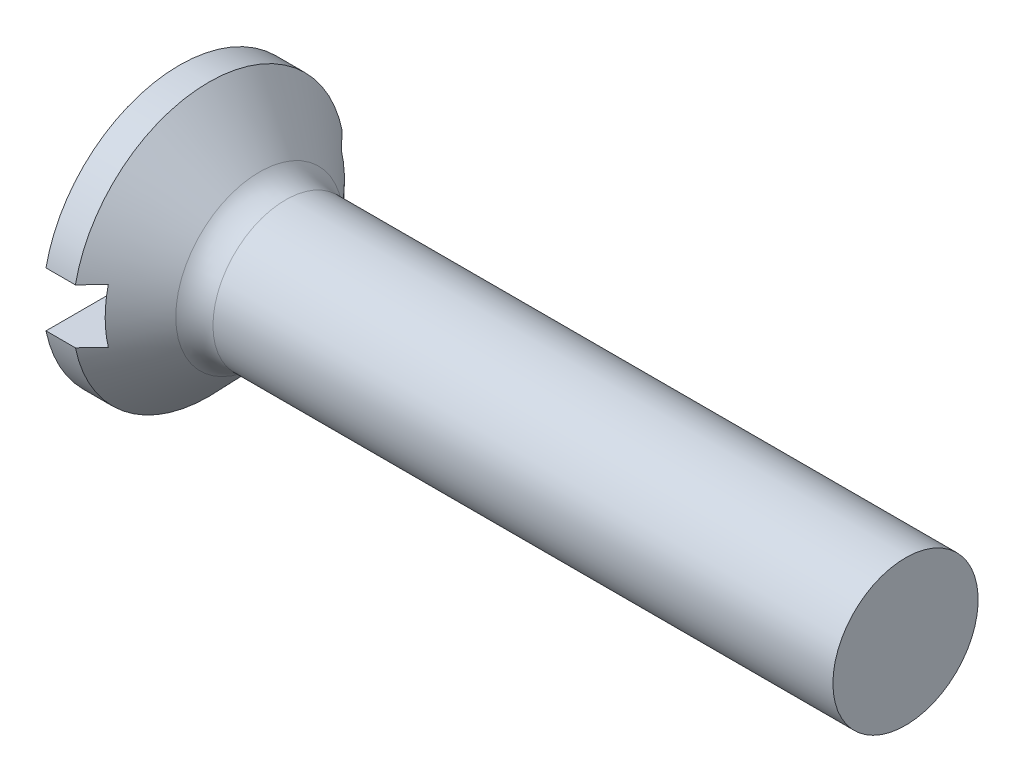
ISO-10303-21;
HEADER;
FILE_DESCRIPTION(('STEP AP214'),'2;1');
FILE_NAME('part.step','',(''),(''),'','','');
FILE_SCHEMA(('AUTOMOTIVE_DESIGN { 1 0 10303 214 1 1 1 1 }'));
ENDSEC;
DATA;
#1=APPLICATION_CONTEXT('core data for automotive mechanical design processes');
#2=APPLICATION_PROTOCOL_DEFINITION('international standard','automotive_design',2000,#1);
#3=PRODUCT_CONTEXT('',#1,'mechanical');
#4=PRODUCT('Part','Part','',(#3));
#5=PRODUCT_RELATED_PRODUCT_CATEGORY('part','',(#4));
#6=PRODUCT_DEFINITION_FORMATION('','',#4);
#7=PRODUCT_DEFINITION_CONTEXT('part definition',#1,'design');
#8=PRODUCT_DEFINITION('design','',#6,#7);
#9=PRODUCT_DEFINITION_SHAPE('','',#8);
#10=(LENGTH_UNIT() NAMED_UNIT(*) SI_UNIT(.MILLI.,.METRE.));
#11=(NAMED_UNIT(*) PLANE_ANGLE_UNIT() SI_UNIT($,.RADIAN.));
#12=(NAMED_UNIT(*) SI_UNIT($,.STERADIAN.) SOLID_ANGLE_UNIT());
#13=UNCERTAINTY_MEASURE_WITH_UNIT(LENGTH_MEASURE(1.E-05),#10,'distance_accuracy_value','');
#14=(GEOMETRIC_REPRESENTATION_CONTEXT(3) GLOBAL_UNCERTAINTY_ASSIGNED_CONTEXT((#13)) GLOBAL_UNIT_ASSIGNED_CONTEXT((#10,
#11,#12)) REPRESENTATION_CONTEXT('',''));
#15=CARTESIAN_POINT('',(0.,0.,0.));
#16=DIRECTION('',(0.,0.,1.));
#17=DIRECTION('',(1.,0.,0.));
#18=AXIS2_PLACEMENT_3D('',#15,#16,#17);
#19=CARTESIAN_POINT('',(0.,0.,0.));
#20=DIRECTION('',(1.,0.,0.));
#21=DIRECTION('',(0.,0.,-1.));
#22=AXIS2_PLACEMENT_3D('',#19,#20,#21);
#23=PLANE('',#22);
#24=CARTESIAN_POINT('',(0.,0.,0.));
#25=DIRECTION('',(-1.,0.,0.));
#26=DIRECTION('',(0.,0.,1.));
#27=AXIS2_PLACEMENT_3D('',#24,#25,#26);
#28=CIRCLE('',#27,1.5);
#29=CARTESIAN_POINT('',(0.,0.3,1.46969384566991));
#30=VERTEX_POINT('',#29);
#31=CARTESIAN_POINT('',(0.,0.3,-1.46969384566991));
#32=VERTEX_POINT('',#31);
#33=EDGE_CURVE('E144',#30,#32,#28,.T.);
#34=ORIENTED_EDGE('',*,*,#33,.T.);
#35=DIRECTION('',(0.,0.,-1.));
#36=VECTOR('',#35,1.);
#37=CARTESIAN_POINT('',(0.,0.3,-1.5));
#38=LINE('',#37,#36);
#39=EDGE_CURVE('E180',#30,#32,#38,.T.);
#40=ORIENTED_EDGE('',*,*,#39,.F.);
#41=EDGE_LOOP('',(#34,#40));
#42=FACE_BOUND('',#41,.T.);
#43=ADVANCED_FACE('F35',(#42),#23,.F.);
#44=CARTESIAN_POINT('',(0.,0.,0.));
#45=DIRECTION('',(-1.,0.,0.));
#46=DIRECTION('',(0.,0.,1.));
#47=AXIS2_PLACEMENT_3D('',#44,#45,#46);
#48=CYLINDRICAL_SURFACE('',#47,1.5);
#49=CARTESIAN_POINT('',(0.324017857635051,0.,0.));
#50=DIRECTION('',(-1.,0.,0.));
#51=DIRECTION('',(0.,0.,1.));
#52=AXIS2_PLACEMENT_3D('',#49,#50,#51);
#53=CIRCLE('',#52,1.5);
#54=CARTESIAN_POINT('',(0.324017857635051,0.3,1.46969384566991));
#55=VERTEX_POINT('',#54);
#56=CARTESIAN_POINT('',(0.324017857635051,0.3,-1.46969384566991));
#57=VERTEX_POINT('',#56);
#58=EDGE_CURVE('E110',#55,#57,#53,.T.);
#59=ORIENTED_EDGE('',*,*,#58,.T.);
#60=DIRECTION('',(-1.,0.,0.));
#61=VECTOR('',#60,1.);
#62=CARTESIAN_POINT('',(0.,0.3,-1.46969384566991));
#63=LINE('',#62,#61);
#64=EDGE_CURVE('E130',#57,#32,#63,.T.);
#65=ORIENTED_EDGE('',*,*,#64,.T.);
#66=ORIENTED_EDGE('',*,*,#33,.F.);
#67=DIRECTION('',(-1.,0.,0.));
#68=VECTOR('',#67,1.);
#69=CARTESIAN_POINT('',(0.,0.3,1.46969384566991));
#70=LINE('',#69,#68);
#71=EDGE_CURVE('E133',#30,#55,#70,.F.);
#72=ORIENTED_EDGE('',*,*,#71,.T.);
#73=EDGE_LOOP('',(#59,#65,#66,#72));
#74=FACE_BOUND('',#73,.T.);
#75=ADVANCED_FACE('F166',(#74),#48,.T.);
#76=CARTESIAN_POINT('',(0.,-0.3,-1.46969384566991));
#77=VERTEX_POINT('',#76);
#78=CARTESIAN_POINT('',(0.,-0.3,1.46969384566991));
#79=VERTEX_POINT('',#78);
#80=EDGE_CURVE('E129',#77,#79,#28,.T.);
#81=ORIENTED_EDGE('',*,*,#80,.T.);
#82=DIRECTION('',(0.,0.,1.));
#83=VECTOR('',#82,1.);
#84=CARTESIAN_POINT('',(0.,-0.3,-1.5));
#85=LINE('',#84,#83);
#86=EDGE_CURVE('E179',#77,#79,#85,.T.);
#87=ORIENTED_EDGE('',*,*,#86,.F.);
#88=EDGE_LOOP('',(#81,#87));
#89=FACE_BOUND('',#88,.T.);
#90=ADVANCED_FACE('F164',(#89),#23,.F.);
#91=CARTESIAN_POINT('',(0.324017857635051,-0.3,-1.46969384566991));
#92=VERTEX_POINT('',#91);
#93=CARTESIAN_POINT('',(0.324017857635051,-0.3,1.46969384566991));
#94=VERTEX_POINT('',#93);
#95=EDGE_CURVE('E118',#92,#94,#53,.T.);
#96=ORIENTED_EDGE('',*,*,#95,.T.);
#97=DIRECTION('',(-1.,0.,0.));
#98=VECTOR('',#97,1.);
#99=CARTESIAN_POINT('',(0.,-0.3,1.46969384566991));
#100=LINE('',#99,#98);
#101=EDGE_CURVE('E104',#94,#79,#100,.T.);
#102=ORIENTED_EDGE('',*,*,#101,.T.);
#103=ORIENTED_EDGE('',*,*,#80,.F.);
#104=DIRECTION('',(-1.,0.,0.));
#105=VECTOR('',#104,1.);
#106=CARTESIAN_POINT('',(0.,-0.3,-1.46969384566991));
#107=LINE('',#106,#105);
#108=EDGE_CURVE('E122',#77,#92,#107,.F.);
#109=ORIENTED_EDGE('',*,*,#108,.T.);
#110=EDGE_LOOP('',(#96,#102,#103,#109));
#111=FACE_BOUND('',#110,.T.);
#112=ADVANCED_FACE('F126',(#111),#48,.T.);
#113=CARTESIAN_POINT('',(1.,0.,0.));
#114=DIRECTION('',(-1.,0.,0.));
#115=DIRECTION('',(0.,0.,1.));
#116=AXIS2_PLACEMENT_3D('',#113,#114,#115);
#117=CONICAL_SURFACE('',#116,0.8,0.802851455917393);
#118=CARTESIAN_POINT('',(0.5,0.,0.));
#119=DIRECTION('',(-1.,0.,0.));
#120=DIRECTION('',(0.,0.,1.));
#121=AXIS2_PLACEMENT_3D('',#118,#119,#120);
#122=CIRCLE('',#121,1.31776515689529);
#123=CARTESIAN_POINT('',(0.5,0.3,-1.2831621131904));
#124=VERTEX_POINT('',#123);
#125=CARTESIAN_POINT('',(0.5,-0.3,-1.2831621131904));
#126=VERTEX_POINT('',#125);
#127=EDGE_CURVE('E102',#124,#126,#122,.T.);
#128=ORIENTED_EDGE('',*,*,#127,.F.);
#129=CARTESIAN_POINT('',(-1.43053155255319,0.3,3.30329431178607));
#130=CARTESIAN_POINT('',(-1.33513582926089,0.3,3.20410071825577));
#131=CARTESIAN_POINT('',(-1.23975656129917,0.3,3.10489128867227));
#132=CARTESIAN_POINT('',(-1.04903792618966,0.3,2.90641605156989));
#133=CARTESIAN_POINT('',(-0.953698563665048,0.3,2.80715023960874));
#134=CARTESIAN_POINT('',(-0.762834123668967,0.3,2.60829513867844));
#135=CARTESIAN_POINT('',(-0.667309217177746,0.3,2.50870568554986));
#136=CARTESIAN_POINT('',(-0.476362067705895,0.3,2.30944622696844));
#137=CARTESIAN_POINT('',(-0.380939815985731,0.3,2.20977622988936));
#138=CARTESIAN_POINT('',(-0.158443065541814,0.3,1.97706156922643));
#139=CARTESIAN_POINT('',(-0.0314207568387842,0.3,1.84396694373216));
#140=CARTESIAN_POINT('',(0.15879596179555,0.3,1.64398253234019));
#141=CARTESIAN_POINT('',(0.222158957264772,0.3,1.5772531724168));
#142=CARTESIAN_POINT('',(0.348716719985334,0.3,1.44363967727175));
#143=CARTESIAN_POINT('',(0.411911493263912,0.3,1.3767555477603));
#144=CARTESIAN_POINT('',(0.537899048665359,0.3,1.24291474976645));
#145=CARTESIAN_POINT('',(0.600692433925931,0.3,1.17595865023701));
#146=CARTESIAN_POINT('',(0.725882015116373,0.3,1.04165918006304));
#147=CARTESIAN_POINT('',(0.788278155531794,0.3,0.974315757689445));
#148=CARTESIAN_POINT('',(0.912333234126828,0.3,0.839023490187233));
#149=CARTESIAN_POINT('',(0.97399260067384,0.3,0.771075041393541));
#150=CARTESIAN_POINT('',(1.06536577420317,0.3,0.66817308774331));
#151=CARTESIAN_POINT('',(1.09563424962412,0.3,0.633713069344383));
#152=CARTESIAN_POINT('',(1.1555859862301,0.3,0.564288719662177));
#153=CARTESIAN_POINT('',(1.18526930044431,0.3,0.529324434579061));
#154=CARTESIAN_POINT('',(1.22602661193066,0.3,0.479940361223793));
#155=CARTESIAN_POINT('',(1.23751503712209,0.3,0.46586301619486));
#156=CARTESIAN_POINT('',(1.26029319680311,0.3,0.43754717576602));
#157=CARTESIAN_POINT('',(1.27158292205838,0.3,0.423308672926782));
#158=CARTESIAN_POINT('',(1.30513108831964,0.3,0.380229593549705));
#159=CARTESIAN_POINT('',(1.32701177527335,0.3,0.351093274073921));
#160=CARTESIAN_POINT('',(1.36860705506014,0.3,0.292188514085448));
#161=CARTESIAN_POINT('',(1.38835770687773,0.3,0.262446527139197));
#162=CARTESIAN_POINT('',(1.41550970568423,0.3,0.216428464010504));
#163=CARTESIAN_POINT('',(1.4241347001214,0.3,0.200884225126606));
#164=CARTESIAN_POINT('',(1.44019890047568,0.3,0.169201524174603));
#165=CARTESIAN_POINT('',(1.44763910889805,0.3,0.15306357885967));
#166=CARTESIAN_POINT('',(1.46172677383326,0.3,0.117850744482042));
#167=CARTESIAN_POINT('',(1.46813049717326,0.3,0.0986740487024407));
#168=CARTESIAN_POINT('',(1.47773415279259,0.3,0.0596157364030448));
#169=CARTESIAN_POINT('',(1.48095432511064,0.3,0.0397394162666405));
#170=CARTESIAN_POINT('',(1.48349446918328,0.3,-0.000464947925101014));
#171=CARTESIAN_POINT('',(1.48277833768587,0.3,-0.0207954643944767));
#172=CARTESIAN_POINT('',(1.47754834696221,0.3,-0.0610214524750211));
#173=CARTESIAN_POINT('',(1.47301647796549,0.3,-0.0809144011159355));
#174=CARTESIAN_POINT('',(1.46144569963257,0.3,-0.118709489183159));
#175=CARTESIAN_POINT('',(1.45455869918781,0.3,-0.136660926190691));
#176=CARTESIAN_POINT('',(1.43904156942888,0.3,-0.171806899405048));
#177=CARTESIAN_POINT('',(1.43040855850265,0.3,-0.189000126368681));
#178=CARTESIAN_POINT('',(1.41190598384851,0.3,-0.222863159494061));
#179=CARTESIAN_POINT('',(1.40202759994248,0.3,-0.239528050532168));
#180=CARTESIAN_POINT('',(1.3814662130619,0.3,-0.272329212898289));
#181=CARTESIAN_POINT('',(1.37078384752875,0.3,-0.288465888756882));
#182=CARTESIAN_POINT('',(1.33611174546368,0.3,-0.338895128395904));
#183=CARTESIAN_POINT('',(1.31109486683076,0.3,-0.372475857081153));
#184=CARTESIAN_POINT('',(1.25973179005552,0.3,-0.438611336007649));
#185=CARTESIAN_POINT('',(1.23338470930554,0.3,-0.471165381129051));
#186=CARTESIAN_POINT('',(1.1798620340704,0.3,-0.53568574402167));
#187=CARTESIAN_POINT('',(1.15268499938312,0.3,-0.567650865381612));
#188=CARTESIAN_POINT('',(1.09784913690955,0.3,-0.631145474154031));
#189=CARTESIAN_POINT('',(1.07019045602527,0.3,-0.662675089311395));
#190=CARTESIAN_POINT('',(0.986871911771922,0.3,-0.756679697431539));
#191=CARTESIAN_POINT('',(0.93073382193025,0.3,-0.81873004054524));
#192=CARTESIAN_POINT('',(0.817879384438976,0.3,-0.942174696923322));
#193=CARTESIAN_POINT('',(0.761163728756088,0.3,-1.00356964779279));
#194=CARTESIAN_POINT('',(0.616329681312646,0.3,-1.15939810673063));
#195=CARTESIAN_POINT('',(0.527952481003968,0.3,-1.25359097182551));
#196=CARTESIAN_POINT('',(0.350755924552571,0.3,-1.44156149329956));
#197=CARTESIAN_POINT('',(0.261936560355744,0.3,-1.53533914205626));
#198=CARTESIAN_POINT('',(-0.00498726193932889,0.3,-1.81641016428848));
#199=CARTESIAN_POINT('',(-0.183467842318207,0.3,-2.00334624045481));
#200=CARTESIAN_POINT('',(-0.539975605951066,0.3,-2.37595066006525));
#201=CARTESIAN_POINT('',(-0.718000911164244,0.3,-2.56162080556652));
#202=CARTESIAN_POINT('',(-1.07418319967555,0.3,-2.93263641833383));
#203=CARTESIAN_POINT('',(-1.25234005466039,0.3,-3.1179820087474));
#204=CARTESIAN_POINT('',(-1.43053155255319,0.3,-3.30329431178607));
#205=B_SPLINE_CURVE_WITH_KNOTS('',3,(#129,#130,#131,#132,#133,#134,#135,#136,#137,#138,#139,
#140,#141,#142,#143,#144,#145,#146,#147,#148,#149,#150,#151,#152,#153,#154,#155,#156,#157,#158,
#159,#160,#161,#162,#163,#164,#165,#166,#167,#168,#169,#170,#171,#172,#173,#174,#175,#176,#177,
#178,#179,#180,#181,#182,#183,#184,#185,#186,#187,#188,#189,#190,#191,#192,#193,#194,#195,#196,
#197,#198,#199,#200,#201,#202,#203,#204),.UNSPECIFIED.,.F.,.F.,(4,2,2,2,2,2,2,2,2,2,2,2,2,2,2,2,
2,2,2,2,2,2,2,2,2,2,2,2,2,2,2,2,2,2,2,2,2,4),(0.,0.412864898017997,0.825768817449053,
1.23975861890565,1.6537098314083,2.20565082425069,2.48171055303832,2.7577602540304,
3.03314072543986,3.30855887143395,3.58380822405222,3.72140261883902,3.8589844865189,
3.91349362434268,3.96800528875168,4.07729377549506,4.18426783007935,4.23756293977621,
4.29081271147001,4.35127235114075,4.4113450864484,4.47196971488777,4.53288209796171,
4.59043796217601,4.64808960319629,4.7061752795369,4.7642153778776,4.88975960042043,
5.01538824702797,5.14124889846094,5.26707181238107,5.51808929137878,5.76883496516087,
6.15631706913225,6.54380625718562,7.31917722132677,8.09086223556229,8.86211803788931),.UNSPECIFIED.);
#206=EDGE_CURVE('E11',#124,#57,#205,.T.);
#207=ORIENTED_EDGE('',*,*,#206,.T.);
#208=ORIENTED_EDGE('',*,*,#58,.F.);
#209=CARTESIAN_POINT('',(0.5,0.3,1.2831621131904));
#210=VERTEX_POINT('',#209);
#211=EDGE_CURVE('E39',#55,#210,#205,.T.);
#212=ORIENTED_EDGE('',*,*,#211,.T.);
#213=CARTESIAN_POINT('',(0.5,-0.3,1.2831621131904));
#214=VERTEX_POINT('',#213);
#215=EDGE_CURVE('E93',#214,#210,#122,.T.);
#216=ORIENTED_EDGE('',*,*,#215,.F.);
#217=CARTESIAN_POINT('',(-1.43053155255319,-0.3,-3.30329431178607));
#218=CARTESIAN_POINT('',(-1.33513582926089,-0.3,-3.20410071825577));
#219=CARTESIAN_POINT('',(-1.23975656129917,-0.3,-3.10489128867227));
#220=CARTESIAN_POINT('',(-1.04903792618966,-0.3,-2.90641605156989));
#221=CARTESIAN_POINT('',(-0.953698563665046,-0.3,-2.80715023960874));
#222=CARTESIAN_POINT('',(-0.762834123668965,-0.3,-2.60829513867844));
#223=CARTESIAN_POINT('',(-0.667309217177744,-0.3,-2.50870568554985));
#224=CARTESIAN_POINT('',(-0.476362067705892,-0.3,-2.30944622696843));
#225=CARTESIAN_POINT('',(-0.380939815985728,-0.3,-2.20977622988935));
#226=CARTESIAN_POINT('',(-0.158443065541811,-0.3,-1.97706156922643));
#227=CARTESIAN_POINT('',(-0.0314207568387815,-0.3,-1.84396694373216));
#228=CARTESIAN_POINT('',(0.158795961795553,-0.3,-1.64398253234019));
#229=CARTESIAN_POINT('',(0.222158957264774,-0.3,-1.5772531724168));
#230=CARTESIAN_POINT('',(0.348716719985336,-0.3,-1.44363967727175));
#231=CARTESIAN_POINT('',(0.411911493263914,-0.3,-1.3767555477603));
#232=CARTESIAN_POINT('',(0.53789904866536,-0.3,-1.24291474976644));
#233=CARTESIAN_POINT('',(0.600692433925932,-0.3,-1.17595865023701));
#234=CARTESIAN_POINT('',(0.725882015116373,-0.3,-1.04165918006304));
#235=CARTESIAN_POINT('',(0.788278155531795,-0.3,-0.974315757689444));
#236=CARTESIAN_POINT('',(0.912333234126828,-0.3,-0.839023490187232));
#237=CARTESIAN_POINT('',(0.973992600673841,-0.3,-0.77107504139354));
#238=CARTESIAN_POINT('',(1.06536577420317,-0.3,-0.668173087743309));
#239=CARTESIAN_POINT('',(1.09563424962413,-0.3,-0.633713069344383));
#240=CARTESIAN_POINT('',(1.1555859862301,-0.3,-0.564288719662177));
#241=CARTESIAN_POINT('',(1.18526930044431,-0.3,-0.529324434579061));
#242=CARTESIAN_POINT('',(1.22602661193066,-0.3,-0.479940361223794));
#243=CARTESIAN_POINT('',(1.23751503712209,-0.3,-0.46586301619486));
#244=CARTESIAN_POINT('',(1.26029319680311,-0.3,-0.43754717576602));
#245=CARTESIAN_POINT('',(1.27158292205838,-0.3,-0.423308672926783));
#246=CARTESIAN_POINT('',(1.30513108831964,-0.3,-0.380229593549706));
#247=CARTESIAN_POINT('',(1.32701177527335,-0.3,-0.351093274073922));
#248=CARTESIAN_POINT('',(1.36860705506014,-0.3,-0.292188514085449));
#249=CARTESIAN_POINT('',(1.38835770687773,-0.3,-0.262446527139198));
#250=CARTESIAN_POINT('',(1.41550970568423,-0.3,-0.216428464010504));
#251=CARTESIAN_POINT('',(1.4241347001214,-0.3,-0.200884225126606));
#252=CARTESIAN_POINT('',(1.44019890047568,-0.3,-0.169201524174603));
#253=CARTESIAN_POINT('',(1.44763910889805,-0.3,-0.15306357885967));
#254=CARTESIAN_POINT('',(1.46172677383326,-0.3,-0.117850744482043));
#255=CARTESIAN_POINT('',(1.46813049717326,-0.3,-0.0986740487024411));
#256=CARTESIAN_POINT('',(1.47773415279259,-0.3,-0.0596157364030452));
#257=CARTESIAN_POINT('',(1.48095432511064,-0.3,-0.0397394162666409));
#258=CARTESIAN_POINT('',(1.48349446918328,-0.3,0.00046494792510056));
#259=CARTESIAN_POINT('',(1.48277833768587,-0.3,0.0207954643944761));
#260=CARTESIAN_POINT('',(1.47754834696221,-0.3,0.0610214524750206));
#261=CARTESIAN_POINT('',(1.47301647796549,-0.3,0.0809144011159351));
#262=CARTESIAN_POINT('',(1.46144569963257,-0.3,0.118709489183158));
#263=CARTESIAN_POINT('',(1.45455869918781,-0.3,0.13666092619069));
#264=CARTESIAN_POINT('',(1.43904156942888,-0.3,0.171806899405048));
#265=CARTESIAN_POINT('',(1.43040855850265,-0.3,0.189000126368681));
#266=CARTESIAN_POINT('',(1.41190598384851,-0.3,0.222863159494061));
#267=CARTESIAN_POINT('',(1.40202759994248,-0.3,0.239528050532167));
#268=CARTESIAN_POINT('',(1.3814662130619,-0.3,0.272329212898288));
#269=CARTESIAN_POINT('',(1.37078384752875,-0.3,0.288465888756882));
#270=CARTESIAN_POINT('',(1.33611174546368,-0.3,0.338895128395903));
#271=CARTESIAN_POINT('',(1.31109486683076,-0.3,0.372475857081152));
#272=CARTESIAN_POINT('',(1.25973179005552,-0.3,0.438611336007648));
#273=CARTESIAN_POINT('',(1.23338470930554,-0.3,0.47116538112905));
#274=CARTESIAN_POINT('',(1.1798620340704,-0.3,0.535685744021669));
#275=CARTESIAN_POINT('',(1.15268499938312,-0.3,0.567650865381611));
#276=CARTESIAN_POINT('',(1.09784913690955,-0.3,0.63114547415403));
#277=CARTESIAN_POINT('',(1.07019045602527,-0.3,0.662675089311394));
#278=CARTESIAN_POINT('',(0.986871911771924,-0.3,0.756679697431537));
#279=CARTESIAN_POINT('',(0.930733821930252,-0.3,0.818730040545238));
#280=CARTESIAN_POINT('',(0.817879384438978,-0.3,0.942174696923319));
#281=CARTESIAN_POINT('',(0.76116372875609,-0.3,1.00356964779279));
#282=CARTESIAN_POINT('',(0.616329681312648,-0.3,1.15939810673063));
#283=CARTESIAN_POINT('',(0.527952481003971,-0.3,1.25359097182551));
#284=CARTESIAN_POINT('',(0.350755924552572,-0.3,1.44156149329956));
#285=CARTESIAN_POINT('',(0.261936560355745,-0.3,1.53533914205625));
#286=CARTESIAN_POINT('',(-0.0049872619393287,-0.3,1.81641016428848));
#287=CARTESIAN_POINT('',(-0.183467842318208,-0.3,2.00334624045481));
#288=CARTESIAN_POINT('',(-0.539975605951067,-0.3,2.37595066006525));
#289=CARTESIAN_POINT('',(-0.718000911164244,-0.3,2.56162080556652));
#290=CARTESIAN_POINT('',(-1.07418319967555,-0.3,2.93263641833383));
#291=CARTESIAN_POINT('',(-1.25234005466039,-0.3,3.1179820087474));
#292=CARTESIAN_POINT('',(-1.43053155255319,-0.3,3.30329431178607));
#293=B_SPLINE_CURVE_WITH_KNOTS('',3,(#217,#218,#219,#220,#221,#222,#223,#224,#225,#226,#227,
#228,#229,#230,#231,#232,#233,#234,#235,#236,#237,#238,#239,#240,#241,#242,#243,#244,#245,#246,
#247,#248,#249,#250,#251,#252,#253,#254,#255,#256,#257,#258,#259,#260,#261,#262,#263,#264,#265,
#266,#267,#268,#269,#270,#271,#272,#273,#274,#275,#276,#277,#278,#279,#280,#281,#282,#283,#284,
#285,#286,#287,#288,#289,#290,#291,#292),.UNSPECIFIED.,.F.,.F.,(4,2,2,2,2,2,2,2,2,2,2,2,2,2,2,2,
2,2,2,2,2,2,2,2,2,2,2,2,2,2,2,2,2,2,2,2,2,4),(0.,0.412864898017998,0.825768817449055,
1.23975861890565,1.6537098314083,2.2056508242507,2.48171055303832,2.75776025403041,
3.03314072543987,3.30855887143396,3.58380822405222,3.72140261883902,3.8589844865189,
3.91349362434268,3.96800528875168,4.07729377549506,4.18426783007935,4.23756293977621,
4.29081271147001,4.35127235114075,4.4113450864484,4.47196971488777,4.53288209796171,
4.59043796217601,4.64808960319629,4.7061752795369,4.7642153778776,4.88975960042043,
5.01538824702797,5.14124889846094,5.26707181238107,5.51808929137878,5.76883496516086,
6.15631706913225,6.54380625718562,7.31917722132677,8.0908622355623,8.86211803788931),.UNSPECIFIED.);
#294=EDGE_CURVE('E99',#214,#94,#293,.T.);
#295=ORIENTED_EDGE('',*,*,#294,.T.);
#296=ORIENTED_EDGE('',*,*,#95,.F.);
#297=EDGE_CURVE('E49',#92,#126,#293,.T.);
#298=ORIENTED_EDGE('',*,*,#297,.T.);
#299=EDGE_LOOP('',(#128,#207,#208,#212,#216,#295,#296,#298));
#300=FACE_BOUND('',#299,.T.);
#301=CARTESIAN_POINT('',(0.882054006348381,0.,0.));
#302=DIRECTION('',(-1.,0.,0.));
#303=DIRECTION('',(0.,0.,1.));
#304=AXIS2_PLACEMENT_3D('',#301,#302,#303);
#305=CIRCLE('',#304,0.922136651816401);
#306=CARTESIAN_POINT('',(0.882054006348381,0.,0.922136651816401));
#307=VERTEX_POINT('',#306);
#308=EDGE_CURVE('E145',#307,#307,#305,.T.);
#309=ORIENTED_EDGE('',*,*,#308,.T.);
#310=EDGE_LOOP('',(#309));
#311=FACE_BOUND('',#310,.T.);
#312=ADVANCED_FACE('F107',(#300,#311),#117,.T.);
#313=CARTESIAN_POINT('',(0.,0.,0.));
#314=DIRECTION('',(-1.,0.,0.));
#315=DIRECTION('',(0.,0.,1.));
#316=AXIS2_PLACEMENT_3D('',#313,#314,#315);
#317=CYLINDRICAL_SURFACE('',#316,0.8);
#318=CARTESIAN_POINT('',(1.16978992648384,0.,0.));
#319=DIRECTION('',(-1.,0.,0.));
#320=DIRECTION('',(0.,0.,1.));
#321=AXIS2_PLACEMENT_3D('',#318,#319,#320);
#322=CIRCLE('',#321,0.8);
#323=CARTESIAN_POINT('',(1.16978992648384,0.,0.8));
#324=VERTEX_POINT('',#323);
#325=EDGE_CURVE('E100',#324,#324,#322,.F.);
#326=ORIENTED_EDGE('',*,*,#325,.T.);
#327=EDGE_LOOP('',(#326));
#328=FACE_BOUND('',#327,.T.);
#329=CARTESIAN_POINT('',(8.,0.,0.));
#330=DIRECTION('',(-1.,0.,0.));
#331=DIRECTION('',(0.,0.,1.));
#332=AXIS2_PLACEMENT_3D('',#329,#330,#331);
#333=CIRCLE('',#332,0.8);
#334=CARTESIAN_POINT('',(8.,0.,0.8));
#335=VERTEX_POINT('',#334);
#336=EDGE_CURVE('E139',#335,#335,#333,.T.);
#337=ORIENTED_EDGE('',*,*,#336,.T.);
#338=EDGE_LOOP('',(#337));
#339=FACE_BOUND('',#338,.T.);
#340=ADVANCED_FACE('F151',(#328,#339),#317,.T.);
#341=CARTESIAN_POINT('',(8.,0.8,0.));
#342=DIRECTION('',(-1.,0.,0.));
#343=DIRECTION('',(0.,0.,1.));
#344=AXIS2_PLACEMENT_3D('',#341,#342,#343);
#345=PLANE('',#344);
#346=ORIENTED_EDGE('',*,*,#336,.F.);
#347=EDGE_LOOP('',(#346));
#348=FACE_BOUND('',#347,.T.);
#349=ADVANCED_FACE('F156',(#348),#345,.F.);
#350=CARTESIAN_POINT('',(1.16978992648384,0.,0.));
#351=DIRECTION('',(-1.,0.,0.));
#352=DIRECTION('',(0.,0.,1.));
#353=AXIS2_PLACEMENT_3D('',#350,#351,#352);
#354=TOROIDAL_SURFACE('',#353,1.2,0.4);
#355=ORIENTED_EDGE('',*,*,#325,.F.);
#356=EDGE_LOOP('',(#355));
#357=FACE_BOUND('',#356,.T.);
#358=ORIENTED_EDGE('',*,*,#308,.F.);
#359=EDGE_LOOP('',(#358));
#360=FACE_BOUND('',#359,.T.);
#361=ADVANCED_FACE('F37',(#357,#360),#354,.F.);
#362=CARTESIAN_POINT('',(0.5,0.3,-1.5));
#363=DIRECTION('',(0.,1.,0.));
#364=DIRECTION('',(0.,0.,1.));
#365=AXIS2_PLACEMENT_3D('',#362,#363,#364);
#366=PLANE('',#365);
#367=ORIENTED_EDGE('',*,*,#39,.T.);
#368=ORIENTED_EDGE('',*,*,#64,.F.);
#369=ORIENTED_EDGE('',*,*,#206,.F.);
#370=DIRECTION('',(0.,0.,-1.));
#371=VECTOR('',#370,1.);
#372=CARTESIAN_POINT('',(0.5,0.3,-1.5));
#373=LINE('',#372,#371);
#374=EDGE_CURVE('E95',#210,#124,#373,.T.);
#375=ORIENTED_EDGE('',*,*,#374,.F.);
#376=ORIENTED_EDGE('',*,*,#211,.F.);
#377=ORIENTED_EDGE('',*,*,#71,.F.);
#378=EDGE_LOOP('',(#367,#368,#369,#375,#376,#377));
#379=FACE_BOUND('',#378,.T.);
#380=ADVANCED_FACE('F103',(#379),#366,.F.);
#381=CARTESIAN_POINT('',(0.5,-0.3,-1.5));
#382=DIRECTION('',(0.,-1.,0.));
#383=DIRECTION('',(0.,0.,-1.));
#384=AXIS2_PLACEMENT_3D('',#381,#382,#383);
#385=PLANE('',#384);
#386=ORIENTED_EDGE('',*,*,#86,.T.);
#387=ORIENTED_EDGE('',*,*,#101,.F.);
#388=ORIENTED_EDGE('',*,*,#294,.F.);
#389=DIRECTION('',(0.,0.,1.));
#390=VECTOR('',#389,1.);
#391=CARTESIAN_POINT('',(0.5,-0.3,-1.5));
#392=LINE('',#391,#390);
#393=EDGE_CURVE('E56',#126,#214,#392,.T.);
#394=ORIENTED_EDGE('',*,*,#393,.F.);
#395=ORIENTED_EDGE('',*,*,#297,.F.);
#396=ORIENTED_EDGE('',*,*,#108,.F.);
#397=EDGE_LOOP('',(#386,#387,#388,#394,#395,#396));
#398=FACE_BOUND('',#397,.T.);
#399=ADVANCED_FACE('F121',(#398),#385,.F.);
#400=CARTESIAN_POINT('',(0.5,-0.3,-1.5));
#401=DIRECTION('',(-1.,0.,0.));
#402=DIRECTION('',(0.,0.,1.));
#403=AXIS2_PLACEMENT_3D('',#400,#401,#402);
#404=PLANE('',#403);
#405=ORIENTED_EDGE('',*,*,#127,.T.);
#406=ORIENTED_EDGE('',*,*,#393,.T.);
#407=ORIENTED_EDGE('',*,*,#215,.T.);
#408=ORIENTED_EDGE('',*,*,#374,.T.);
#409=EDGE_LOOP('',(#405,#406,#407,#408));
#410=FACE_BOUND('',#409,.T.);
#411=ADVANCED_FACE('F94',(#410),#404,.T.);
#412=CLOSED_SHELL('',(#43,#75,#90,#112,#312,#340,#349,#361,#380,#399,#411));
#413=MANIFOLD_SOLID_BREP('B2',#412);
#414=ADVANCED_BREP_SHAPE_REPRESENTATION('',(#18,#413),#14);
#415=SHAPE_DEFINITION_REPRESENTATION(#9,#414);
ENDSEC;
END-ISO-10303-21;
